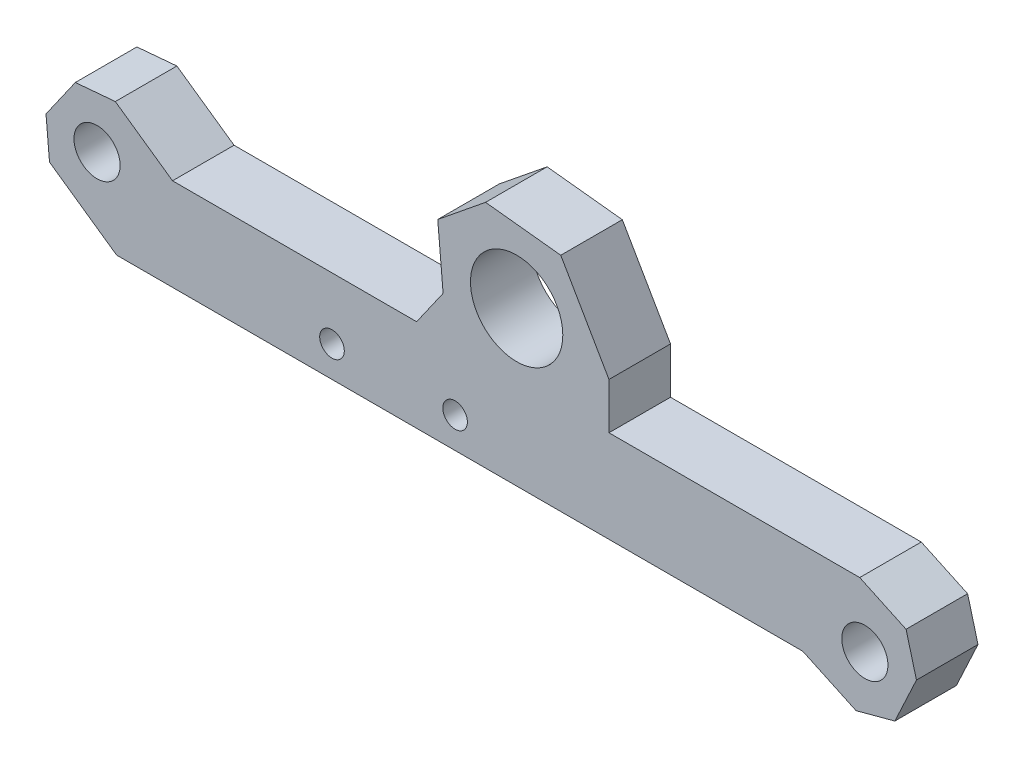
ISO-10303-21;
HEADER;
FILE_DESCRIPTION(('STEP AP214'),'2;1');
FILE_NAME('part.step','',(''),(''),'','','');
FILE_SCHEMA(('AUTOMOTIVE_DESIGN { 1 0 10303 214 1 1 1 1 }'));
ENDSEC;
DATA;
#1=APPLICATION_CONTEXT('core data for automotive mechanical design processes');
#2=APPLICATION_PROTOCOL_DEFINITION('international standard','automotive_design',2000,#1);
#3=PRODUCT_CONTEXT('',#1,'mechanical');
#4=PRODUCT('Part','Part','',(#3));
#5=PRODUCT_RELATED_PRODUCT_CATEGORY('part','',(#4));
#6=PRODUCT_DEFINITION_FORMATION('','',#4);
#7=PRODUCT_DEFINITION_CONTEXT('part definition',#1,'design');
#8=PRODUCT_DEFINITION('design','',#6,#7);
#9=PRODUCT_DEFINITION_SHAPE('','',#8);
#10=(LENGTH_UNIT() NAMED_UNIT(*) SI_UNIT(.MILLI.,.METRE.));
#11=(NAMED_UNIT(*) PLANE_ANGLE_UNIT() SI_UNIT($,.RADIAN.));
#12=(NAMED_UNIT(*) SI_UNIT($,.STERADIAN.) SOLID_ANGLE_UNIT());
#13=UNCERTAINTY_MEASURE_WITH_UNIT(LENGTH_MEASURE(1.E-05),#10,'distance_accuracy_value','');
#14=(GEOMETRIC_REPRESENTATION_CONTEXT(3) GLOBAL_UNCERTAINTY_ASSIGNED_CONTEXT((#13)) GLOBAL_UNIT_ASSIGNED_CONTEXT((#10,
#11,#12)) REPRESENTATION_CONTEXT('',''));
#15=CARTESIAN_POINT('',(0.,0.,0.));
#16=DIRECTION('',(0.,0.,1.));
#17=DIRECTION('',(1.,0.,0.));
#18=AXIS2_PLACEMENT_3D('',#15,#16,#17);
#19=CARTESIAN_POINT('',(0.,0.,4.));
#20=DIRECTION('',(0.,0.,-1.));
#21=DIRECTION('',(-1.,0.,0.));
#22=AXIS2_PLACEMENT_3D('',#19,#20,#21);
#23=PLANE('',#22);
#24=CARTESIAN_POINT('',(14.,2.,4.));
#25=DIRECTION('',(0.,0.,1.));
#26=DIRECTION('',(1.,0.,0.));
#27=AXIS2_PLACEMENT_3D('',#24,#25,#26);
#28=CIRCLE('',#27,0.79999999999999);
#29=CARTESIAN_POINT('',(14.8,2.,4.));
#30=VERTEX_POINT('',#29);
#31=EDGE_CURVE('E208',#30,#30,#28,.T.);
#32=ORIENTED_EDGE('',*,*,#31,.F.);
#33=EDGE_LOOP('',(#32));
#34=FACE_BOUND('',#33,.T.);
#35=CARTESIAN_POINT('',(22.,2.,4.));
#36=DIRECTION('',(0.,0.,1.));
#37=DIRECTION('',(1.,0.,0.));
#38=AXIS2_PLACEMENT_3D('',#35,#36,#37);
#39=CIRCLE('',#38,0.799999999999988);
#40=CARTESIAN_POINT('',(22.8,2.,4.));
#41=VERTEX_POINT('',#40);
#42=EDGE_CURVE('E205',#41,#41,#39,.T.);
#43=ORIENTED_EDGE('',*,*,#42,.F.);
#44=EDGE_LOOP('',(#43));
#45=FACE_BOUND('',#44,.T.);
#46=CARTESIAN_POINT('',(-1.2690906499273,5.16133790041566,4.));
#47=DIRECTION('',(0.,0.,1.));
#48=DIRECTION('',(1.,0.,0.));
#49=AXIS2_PLACEMENT_3D('',#46,#47,#48);
#50=CIRCLE('',#49,1.5);
#51=CARTESIAN_POINT('',(0.230909350072699,5.16133790041566,4.));
#52=VERTEX_POINT('',#51);
#53=EDGE_CURVE('E622',#52,#52,#50,.T.);
#54=ORIENTED_EDGE('',*,*,#53,.F.);
#55=EDGE_LOOP('',(#54));
#56=FACE_BOUND('',#55,.T.);
#57=DIRECTION('',(0.906307787036649,-0.422618261740701,0.));
#58=VECTOR('',#57,1.);
#59=CARTESIAN_POINT('',(44.5999475740209,0.,4.));
#60=LINE('',#59,#58);
#61=CARTESIAN_POINT('',(44.5999475740209,0.,4.));
#62=VERTEX_POINT('',#61);
#63=CARTESIAN_POINT('',(48.0569126619561,-1.61200929447864,4.));
#64=VERTEX_POINT('',#63);
#65=EDGE_CURVE('E187',#62,#64,#60,.T.);
#66=ORIENTED_EDGE('',*,*,#65,.T.);
#67=DIRECTION('',(-0.965925826289069,-0.258819045102517,0.));
#68=VECTOR('',#67,1.);
#69=CARTESIAN_POINT('',(50.5787658911402,-0.936280758288942,4.));
#70=LINE('',#69,#68);
#71=CARTESIAN_POINT('',(50.5787658911402,-0.936280758288942,4.));
#72=VERTEX_POINT('',#71);
#73=EDGE_CURVE('E226',#64,#72,#70,.F.);
#74=ORIENTED_EDGE('',*,*,#73,.T.);
#75=DIRECTION('',(0.422618261740699,0.90630778703665,0.));
#76=VECTOR('',#75,1.);
#77=CARTESIAN_POINT('',(49.8695282360294,-2.45724581796004,4.));
#78=LINE('',#77,#76);
#79=CARTESIAN_POINT('',(51.9826195447329,2.0742931172232,4.));
#80=VERTEX_POINT('',#79);
#81=EDGE_CURVE('E343',#72,#80,#78,.T.);
#82=ORIENTED_EDGE('',*,*,#81,.T.);
#83=DIRECTION('',(0.258819045102522,-0.965925826289068,0.));
#84=VECTOR('',#83,1.);
#85=CARTESIAN_POINT('',(51.3068910085432,4.59614634640732,4.));
#86=LINE('',#85,#84);
#87=CARTESIAN_POINT('',(51.3068910085432,4.59614634640732,4.));
#88=VERTEX_POINT('',#87);
#89=EDGE_CURVE('E224',#80,#88,#86,.F.);
#90=ORIENTED_EDGE('',*,*,#89,.T.);
#91=DIRECTION('',(-0.906307787036649,0.4226182617407,0.));
#92=VECTOR('',#91,1.);
#93=CARTESIAN_POINT('',(48.2963171330311,6.00000000000001,4.));
#94=LINE('',#93,#92);
#95=CARTESIAN_POINT('',(48.2963171330311,6.00000000000001,4.));
#96=VERTEX_POINT('',#95);
#97=EDGE_CURVE('E342',#88,#96,#94,.T.);
#98=ORIENTED_EDGE('',*,*,#97,.T.);
#99=DIRECTION('',(-1.,0.,0.));
#100=VECTOR('',#99,1.);
#101=CARTESIAN_POINT('',(48.2963171330311,6.00000000000001,4.));
#102=LINE('',#101,#100);
#103=CARTESIAN_POINT('',(32.,6.,4.));
#104=VERTEX_POINT('',#103);
#105=EDGE_CURVE('E283',#96,#104,#102,.T.);
#106=ORIENTED_EDGE('',*,*,#105,.T.);
#107=DIRECTION('',(0.,1.,0.));
#108=VECTOR('',#107,1.);
#109=CARTESIAN_POINT('',(32.,9.,4.));
#110=LINE('',#109,#108);
#111=CARTESIAN_POINT('',(32.,9.,4.));
#112=VERTEX_POINT('',#111);
#113=EDGE_CURVE('E346',#104,#112,#110,.T.);
#114=ORIENTED_EDGE('',*,*,#113,.T.);
#115=DIRECTION('',(-0.500000000000001,0.866025403784438,0.));
#116=VECTOR('',#115,1.);
#117=CARTESIAN_POINT('',(28.8672456816101,14.426089647082,4.));
#118=LINE('',#117,#116);
#119=CARTESIAN_POINT('',(28.8672456816101,14.426089647082,4.));
#120=VERTEX_POINT('',#119);
#121=EDGE_CURVE('E352',#112,#120,#118,.T.);
#122=ORIENTED_EDGE('',*,*,#121,.T.);
#123=DIRECTION('',(-0.994094540524916,0.108517484759628,0.));
#124=VECTOR('',#123,1.);
#125=CARTESIAN_POINT('',(28.8672456816101,14.426089647082,4.));
#126=LINE('',#125,#124);
#127=CARTESIAN_POINT('',(23.9806901838903,14.9595164894333,4.));
#128=VERTEX_POINT('',#127);
#129=EDGE_CURVE('E354',#120,#128,#126,.T.);
#130=ORIENTED_EDGE('',*,*,#129,.T.);
#131=DIRECTION('',(-0.777145961456968,-0.62932039104984,0.));
#132=VECTOR('',#131,1.);
#133=CARTESIAN_POINT('',(23.9806901838903,14.9595164894333,4.));
#134=LINE('',#133,#132);
#135=CARTESIAN_POINT('',(20.8721063380625,12.442234925234,4.));
#136=VERTEX_POINT('',#135);
#137=EDGE_CURVE('E356',#128,#136,#134,.T.);
#138=ORIENTED_EDGE('',*,*,#137,.T.);
#139=DIRECTION('',(0.0871557427476631,-0.996194698091745,0.));
#140=VECTOR('',#139,1.);
#141=CARTESIAN_POINT('',(20.8721063380625,12.442234925234,4.));
#142=LINE('',#141,#140);
#143=CARTESIAN_POINT('',(21.2207293090531,8.45745613286698,4.));
#144=VERTEX_POINT('',#143);
#145=EDGE_CURVE('E358',#136,#144,#142,.T.);
#146=ORIENTED_EDGE('',*,*,#145,.T.);
#147=DIRECTION('',(-0.573576436351041,-0.819152044288995,0.));
#148=VECTOR('',#147,1.);
#149=CARTESIAN_POINT('',(21.2207293090531,8.45745613286698,4.));
#150=LINE('',#149,#148);
#151=CARTESIAN_POINT('',(19.5,5.99999999999999,4.));
#152=VERTEX_POINT('',#151);
#153=EDGE_CURVE('E321',#144,#152,#150,.T.);
#154=ORIENTED_EDGE('',*,*,#153,.T.);
#155=DIRECTION('',(-1.,0.,0.));
#156=VECTOR('',#155,1.);
#157=CARTESIAN_POINT('',(19.5,5.99999999999999,4.));
#158=LINE('',#157,#156);
#159=CARTESIAN_POINT('',(3.635239528895,6.,4.));
#160=VERTEX_POINT('',#159);
#161=EDGE_CURVE('E318',#152,#160,#158,.T.);
#162=ORIENTED_EDGE('',*,*,#161,.T.);
#163=DIRECTION('',(-0.819152044288991,0.573576436351047,0.));
#164=VECTOR('',#163,1.);
#165=CARTESIAN_POINT('',(3.635239528895,6.,4.));
#166=LINE('',#165,#164);
#167=CARTESIAN_POINT('',(-0.0807251669876225,8.60194649177817,4.));
#168=VERTEX_POINT('',#167);
#169=EDGE_CURVE('E317',#160,#168,#166,.T.);
#170=ORIENTED_EDGE('',*,*,#169,.T.);
#171=DIRECTION('',(0.996194698091746,0.0871557427476543,0.));
#172=VECTOR('',#171,1.);
#173=CARTESIAN_POINT('',(-2.68160480795389,8.37439900799826,4.));
#174=LINE('',#173,#172);
#175=CARTESIAN_POINT('',(-2.68160480795389,8.37439900799826,4.));
#176=VERTEX_POINT('',#175);
#177=EDGE_CURVE('E58',#168,#176,#174,.F.);
#178=ORIENTED_EDGE('',*,*,#177,.T.);
#179=DIRECTION('',(-0.573576436351047,-0.819152044288992,0.));
#180=VECTOR('',#179,1.);
#181=CARTESIAN_POINT('',(-1.71902925556561,9.74909936448027,4.));
#182=LINE('',#181,#180);
#183=CARTESIAN_POINT('',(-4.58691143732084,5.65333914303532,4.));
#184=VERTEX_POINT('',#183);
#185=EDGE_CURVE('E238',#176,#184,#182,.T.);
#186=ORIENTED_EDGE('',*,*,#185,.T.);
#187=DIRECTION('',(-0.0871557427476553,0.996194698091746,0.));
#188=VECTOR('',#187,1.);
#189=CARTESIAN_POINT('',(-4.35936395354093,3.05245950206905,4.));
#190=LINE('',#189,#188);
#191=CARTESIAN_POINT('',(-4.35936395354093,3.05245950206905,4.));
#192=VERTEX_POINT('',#191);
#193=EDGE_CURVE('E173',#184,#192,#190,.F.);
#194=ORIENTED_EDGE('',*,*,#193,.T.);
#195=DIRECTION('',(0.819152044288991,-0.573576436351047,0.));
#196=VECTOR('',#195,1.);
#197=CARTESIAN_POINT('',(-5.73406431002294,4.01503505445733,4.));
#198=LINE('',#197,#196);
#199=CARTESIAN_POINT('',(0.,0.,4.));
#200=VERTEX_POINT('',#199);
#201=EDGE_CURVE('E166',#192,#200,#198,.T.);
#202=ORIENTED_EDGE('',*,*,#201,.T.);
#203=DIRECTION('',(1.,0.,0.));
#204=VECTOR('',#203,1.);
#205=CARTESIAN_POINT('',(0.,0.,4.));
#206=LINE('',#205,#204);
#207=EDGE_CURVE('E170',#200,#62,#206,.T.);
#208=ORIENTED_EDGE('',*,*,#207,.T.);
#209=EDGE_LOOP('',(#66,#74,#82,#90,#98,#106,#114,#122,#130,#138,#146,#154,#162,#170,#178,#186,
#194,#202,#208));
#210=FACE_BOUND('',#209,.T.);
#211=CARTESIAN_POINT('',(26.,10.,4.));
#212=DIRECTION('',(0.,0.,1.));
#213=DIRECTION('',(1.,0.,0.));
#214=AXIS2_PLACEMENT_3D('',#211,#212,#213);
#215=CIRCLE('',#214,3.);
#216=CARTESIAN_POINT('',(29.,10.,4.));
#217=VERTEX_POINT('',#216);
#218=EDGE_CURVE('E327',#217,#217,#215,.T.);
#219=ORIENTED_EDGE('',*,*,#218,.F.);
#220=EDGE_LOOP('',(#219));
#221=FACE_BOUND('',#220,.T.);
#222=CARTESIAN_POINT('',(48.6297687910119,1.98268622189033,4.));
#223=DIRECTION('',(0.,0.,1.));
#224=DIRECTION('',(-1.,0.,0.));
#225=AXIS2_PLACEMENT_3D('',#222,#223,#224);
#226=CIRCLE('',#225,1.5);
#227=CARTESIAN_POINT('',(47.1297687910119,1.98268622189033,4.));
#228=VERTEX_POINT('',#227);
#229=EDGE_CURVE('E628',#228,#228,#226,.T.);
#230=ORIENTED_EDGE('',*,*,#229,.F.);
#231=EDGE_LOOP('',(#230));
#232=FACE_BOUND('',#231,.T.);
#233=ADVANCED_FACE('F37',(#34,#45,#56,#210,#221,#232),#23,.F.);
#234=CARTESIAN_POINT('',(0.,0.,0.));
#235=DIRECTION('',(0.,0.,-1.));
#236=DIRECTION('',(-1.,0.,0.));
#237=AXIS2_PLACEMENT_3D('',#234,#235,#236);
#238=PLANE('',#237);
#239=CARTESIAN_POINT('',(14.,2.,0.));
#240=DIRECTION('',(0.,0.,-1.));
#241=DIRECTION('',(-1.,0.,0.));
#242=AXIS2_PLACEMENT_3D('',#239,#240,#241);
#243=CIRCLE('',#242,0.799999999999989);
#244=CARTESIAN_POINT('',(13.2,2.,0.));
#245=VERTEX_POINT('',#244);
#246=EDGE_CURVE('E206',#245,#245,#243,.T.);
#247=ORIENTED_EDGE('',*,*,#246,.F.);
#248=EDGE_LOOP('',(#247));
#249=FACE_BOUND('',#248,.T.);
#250=CARTESIAN_POINT('',(22.,2.,0.));
#251=DIRECTION('',(0.,0.,-1.));
#252=DIRECTION('',(-1.,0.,0.));
#253=AXIS2_PLACEMENT_3D('',#250,#251,#252);
#254=CIRCLE('',#253,0.799999999999988);
#255=CARTESIAN_POINT('',(21.2,2.,0.));
#256=VERTEX_POINT('',#255);
#257=EDGE_CURVE('E201',#256,#256,#254,.T.);
#258=ORIENTED_EDGE('',*,*,#257,.F.);
#259=EDGE_LOOP('',(#258));
#260=FACE_BOUND('',#259,.T.);
#261=CARTESIAN_POINT('',(-1.2690906499273,5.16133790041566,0.));
#262=DIRECTION('',(0.,0.,1.));
#263=DIRECTION('',(1.,0.,0.));
#264=AXIS2_PLACEMENT_3D('',#261,#262,#263);
#265=CIRCLE('',#264,1.5);
#266=CARTESIAN_POINT('',(0.230909350072699,5.16133790041566,0.));
#267=VERTEX_POINT('',#266);
#268=EDGE_CURVE('E625',#267,#267,#265,.T.);
#269=ORIENTED_EDGE('',*,*,#268,.T.);
#270=EDGE_LOOP('',(#269));
#271=FACE_BOUND('',#270,.T.);
#272=DIRECTION('',(0.422618261740699,0.90630778703665,0.));
#273=VECTOR('',#272,1.);
#274=CARTESIAN_POINT('',(49.8695282360294,-2.45724581796004,0.));
#275=LINE('',#274,#273);
#276=CARTESIAN_POINT('',(50.5787658911402,-0.936280758288931,0.));
#277=VERTEX_POINT('',#276);
#278=CARTESIAN_POINT('',(51.9826195447329,2.07429311722321,0.));
#279=VERTEX_POINT('',#278);
#280=EDGE_CURVE('E294',#277,#279,#275,.T.);
#281=ORIENTED_EDGE('',*,*,#280,.F.);
#282=DIRECTION('',(0.965925826289069,0.258819045102517,0.));
#283=VECTOR('',#282,1.);
#284=CARTESIAN_POINT('',(3.6222050582456,-13.5182533128058,0.));
#285=LINE('',#284,#283);
#286=CARTESIAN_POINT('',(48.0569126619561,-1.61200929447863,0.));
#287=VERTEX_POINT('',#286);
#288=EDGE_CURVE('E218',#277,#287,#285,.F.);
#289=ORIENTED_EDGE('',*,*,#288,.T.);
#290=DIRECTION('',(0.906307787036649,-0.422618261740701,0.));
#291=VECTOR('',#290,1.);
#292=CARTESIAN_POINT('',(44.5999475740209,0.,0.));
#293=LINE('',#292,#291);
#294=CARTESIAN_POINT('',(44.5999475740209,0.,0.));
#295=VERTEX_POINT('',#294);
#296=EDGE_CURVE('E329',#295,#287,#293,.T.);
#297=ORIENTED_EDGE('',*,*,#296,.F.);
#298=DIRECTION('',(1.,0.,0.));
#299=VECTOR('',#298,1.);
#300=CARTESIAN_POINT('',(0.,0.,0.));
#301=LINE('',#300,#299);
#302=CARTESIAN_POINT('',(0.,0.,0.));
#303=VERTEX_POINT('',#302);
#304=EDGE_CURVE('E326',#303,#295,#301,.T.);
#305=ORIENTED_EDGE('',*,*,#304,.F.);
#306=DIRECTION('',(0.819152044288991,-0.573576436351047,0.));
#307=VECTOR('',#306,1.);
#308=CARTESIAN_POINT('',(-5.73406431002294,4.01503505445733,0.));
#309=LINE('',#308,#307);
#310=CARTESIAN_POINT('',(-4.35936395354093,3.05245950206905,0.));
#311=VERTEX_POINT('',#310);
#312=EDGE_CURVE('E191',#311,#303,#309,.T.);
#313=ORIENTED_EDGE('',*,*,#312,.F.);
#314=DIRECTION('',(0.0871557427476553,-0.996194698091746,0.));
#315=VECTOR('',#314,1.);
#316=CARTESIAN_POINT('',(-4.0612226716268,-0.3553109438218,0.));
#317=LINE('',#316,#315);
#318=CARTESIAN_POINT('',(-4.58691143732084,5.65333914303531,0.));
#319=VERTEX_POINT('',#318);
#320=EDGE_CURVE('E214',#311,#319,#317,.F.);
#321=ORIENTED_EDGE('',*,*,#320,.T.);
#322=DIRECTION('',(-0.573576436351047,-0.819152044288992,0.));
#323=VECTOR('',#322,1.);
#324=CARTESIAN_POINT('',(-1.71902925556561,9.74909936448027,0.));
#325=LINE('',#324,#323);
#326=CARTESIAN_POINT('',(-2.68160480795389,8.37439900799826,0.));
#327=VERTEX_POINT('',#326);
#328=EDGE_CURVE('E178',#327,#319,#325,.T.);
#329=ORIENTED_EDGE('',*,*,#328,.F.);
#330=DIRECTION('',(-0.996194698091746,-0.0871557427476543,0.));
#331=VECTOR('',#330,1.);
#332=CARTESIAN_POINT('',(-0.747469364680332,8.54361393300838,0.));
#333=LINE('',#332,#331);
#334=CARTESIAN_POINT('',(-0.0807251669876249,8.60194649177817,0.));
#335=VERTEX_POINT('',#334);
#336=EDGE_CURVE('E212',#327,#335,#333,.F.);
#337=ORIENTED_EDGE('',*,*,#336,.T.);
#338=DIRECTION('',(-0.819152044288991,0.573576436351047,0.));
#339=VECTOR('',#338,1.);
#340=CARTESIAN_POINT('',(3.635239528895,6.,0.));
#341=LINE('',#340,#339);
#342=CARTESIAN_POINT('',(3.635239528895,6.,0.));
#343=VERTEX_POINT('',#342);
#344=EDGE_CURVE('E246',#343,#335,#341,.T.);
#345=ORIENTED_EDGE('',*,*,#344,.F.);
#346=DIRECTION('',(-1.,0.,0.));
#347=VECTOR('',#346,1.);
#348=CARTESIAN_POINT('',(19.5,5.99999999999999,0.));
#349=LINE('',#348,#347);
#350=CARTESIAN_POINT('',(19.5,5.99999999999999,0.));
#351=VERTEX_POINT('',#350);
#352=EDGE_CURVE('E248',#351,#343,#349,.T.);
#353=ORIENTED_EDGE('',*,*,#352,.F.);
#354=DIRECTION('',(-0.573576436351041,-0.819152044288995,0.));
#355=VECTOR('',#354,1.);
#356=CARTESIAN_POINT('',(21.2207293090531,8.45745613286698,0.));
#357=LINE('',#356,#355);
#358=CARTESIAN_POINT('',(21.2207293090531,8.45745613286698,0.));
#359=VERTEX_POINT('',#358);
#360=EDGE_CURVE('E305',#359,#351,#357,.T.);
#361=ORIENTED_EDGE('',*,*,#360,.F.);
#362=DIRECTION('',(0.0871557427476631,-0.996194698091745,0.));
#363=VECTOR('',#362,1.);
#364=CARTESIAN_POINT('',(20.8721063380625,12.442234925234,0.));
#365=LINE('',#364,#363);
#366=CARTESIAN_POINT('',(20.8721063380625,12.442234925234,0.));
#367=VERTEX_POINT('',#366);
#368=EDGE_CURVE('E303',#367,#359,#365,.T.);
#369=ORIENTED_EDGE('',*,*,#368,.F.);
#370=DIRECTION('',(-0.777145961456968,-0.62932039104984,0.));
#371=VECTOR('',#370,1.);
#372=CARTESIAN_POINT('',(23.9806901838903,14.9595164894333,0.));
#373=LINE('',#372,#371);
#374=CARTESIAN_POINT('',(23.9806901838903,14.9595164894333,0.));
#375=VERTEX_POINT('',#374);
#376=EDGE_CURVE('E301',#375,#367,#373,.T.);
#377=ORIENTED_EDGE('',*,*,#376,.F.);
#378=DIRECTION('',(-0.994094540524916,0.108517484759628,0.));
#379=VECTOR('',#378,1.);
#380=CARTESIAN_POINT('',(28.8672456816101,14.426089647082,0.));
#381=LINE('',#380,#379);
#382=CARTESIAN_POINT('',(28.8672456816101,14.426089647082,0.));
#383=VERTEX_POINT('',#382);
#384=EDGE_CURVE('E299',#383,#375,#381,.T.);
#385=ORIENTED_EDGE('',*,*,#384,.F.);
#386=DIRECTION('',(-0.500000000000001,0.866025403784438,0.));
#387=VECTOR('',#386,1.);
#388=CARTESIAN_POINT('',(28.8672456816101,14.426089647082,0.));
#389=LINE('',#388,#387);
#390=CARTESIAN_POINT('',(32.,9.,0.));
#391=VERTEX_POINT('',#390);
#392=EDGE_CURVE('E292',#391,#383,#389,.T.);
#393=ORIENTED_EDGE('',*,*,#392,.F.);
#394=DIRECTION('',(0.,1.,0.));
#395=VECTOR('',#394,1.);
#396=CARTESIAN_POINT('',(32.,9.,0.));
#397=LINE('',#396,#395);
#398=CARTESIAN_POINT('',(32.,6.,0.));
#399=VERTEX_POINT('',#398);
#400=EDGE_CURVE('E290',#399,#391,#397,.T.);
#401=ORIENTED_EDGE('',*,*,#400,.F.);
#402=DIRECTION('',(-1.,0.,0.));
#403=VECTOR('',#402,1.);
#404=CARTESIAN_POINT('',(48.2963171330311,6.00000000000001,0.));
#405=LINE('',#404,#403);
#406=CARTESIAN_POINT('',(48.2963171330311,6.00000000000001,0.));
#407=VERTEX_POINT('',#406);
#408=EDGE_CURVE('E282',#407,#399,#405,.T.);
#409=ORIENTED_EDGE('',*,*,#408,.F.);
#410=DIRECTION('',(-0.906307787036649,0.4226182617407,0.));
#411=VECTOR('',#410,1.);
#412=CARTESIAN_POINT('',(48.2963171330311,6.00000000000001,0.));
#413=LINE('',#412,#411);
#414=CARTESIAN_POINT('',(51.3068910085432,4.59614634640731,0.));
#415=VERTEX_POINT('',#414);
#416=EDGE_CURVE('E288',#415,#407,#413,.T.);
#417=ORIENTED_EDGE('',*,*,#416,.F.);
#418=DIRECTION('',(-0.258819045102522,0.965925826289068,0.));
#419=VECTOR('',#418,1.);
#420=CARTESIAN_POINT('',(49.0190175921723,13.1346061775896,0.));
#421=LINE('',#420,#419);
#422=EDGE_CURVE('E216',#415,#279,#421,.F.);
#423=ORIENTED_EDGE('',*,*,#422,.T.);
#424=EDGE_LOOP('',(#281,#289,#297,#305,#313,#321,#329,#337,#345,#353,#361,#369,#377,#385,#393,
#401,#409,#417,#423));
#425=FACE_BOUND('',#424,.T.);
#426=CARTESIAN_POINT('',(26.,10.,0.));
#427=DIRECTION('',(0.,0.,1.));
#428=DIRECTION('',(1.,0.,0.));
#429=AXIS2_PLACEMENT_3D('',#426,#427,#428);
#430=CIRCLE('',#429,3.);
#431=CARTESIAN_POINT('',(29.,10.,0.));
#432=VERTEX_POINT('',#431);
#433=EDGE_CURVE('E619',#432,#432,#430,.T.);
#434=ORIENTED_EDGE('',*,*,#433,.T.);
#435=EDGE_LOOP('',(#434));
#436=FACE_BOUND('',#435,.T.);
#437=CARTESIAN_POINT('',(48.6297687910119,1.98268622189033,0.));
#438=DIRECTION('',(0.,0.,1.));
#439=DIRECTION('',(-1.,0.,0.));
#440=AXIS2_PLACEMENT_3D('',#437,#438,#439);
#441=CIRCLE('',#440,1.5);
#442=CARTESIAN_POINT('',(47.1297687910119,1.98268622189033,0.));
#443=VERTEX_POINT('',#442);
#444=EDGE_CURVE('E204',#443,#443,#441,.T.);
#445=ORIENTED_EDGE('',*,*,#444,.T.);
#446=EDGE_LOOP('',(#445));
#447=FACE_BOUND('',#446,.T.);
#448=ADVANCED_FACE('F242',(#249,#260,#271,#425,#436,#447),#238,.T.);
#449=CARTESIAN_POINT('',(-5.73406431002294,4.01503505445733,4.));
#450=DIRECTION('',(0.573576436351047,0.819152044288991,0.));
#451=DIRECTION('',(-0.819152044288991,0.573576436351047,0.));
#452=AXIS2_PLACEMENT_3D('',#449,#450,#451);
#453=PLANE('',#452);
#454=ORIENTED_EDGE('',*,*,#201,.F.);
#455=DIRECTION('',(0.,0.,-1.));
#456=VECTOR('',#455,1.);
#457=CARTESIAN_POINT('',(-4.35936395354093,3.05245950206905,4.));
#458=LINE('',#457,#456);
#459=EDGE_CURVE('E231',#192,#311,#458,.T.);
#460=ORIENTED_EDGE('',*,*,#459,.T.);
#461=ORIENTED_EDGE('',*,*,#312,.T.);
#462=DIRECTION('',(0.,0.,-1.));
#463=VECTOR('',#462,1.);
#464=CARTESIAN_POINT('',(0.,0.,4.));
#465=LINE('',#464,#463);
#466=EDGE_CURVE('E183',#200,#303,#465,.T.);
#467=ORIENTED_EDGE('',*,*,#466,.F.);
#468=EDGE_LOOP('',(#454,#460,#461,#467));
#469=FACE_BOUND('',#468,.T.);
#470=ADVANCED_FACE('F189',(#469),#453,.F.);
#471=CARTESIAN_POINT('',(0.,0.,4.));
#472=DIRECTION('',(0.,1.,0.));
#473=DIRECTION('',(0.,0.,1.));
#474=AXIS2_PLACEMENT_3D('',#471,#472,#473);
#475=PLANE('',#474);
#476=ORIENTED_EDGE('',*,*,#304,.T.);
#477=DIRECTION('',(0.,0.,-1.));
#478=VECTOR('',#477,1.);
#479=CARTESIAN_POINT('',(44.5999475740209,0.,4.));
#480=LINE('',#479,#478);
#481=EDGE_CURVE('E185',#62,#295,#480,.T.);
#482=ORIENTED_EDGE('',*,*,#481,.F.);
#483=ORIENTED_EDGE('',*,*,#207,.F.);
#484=ORIENTED_EDGE('',*,*,#466,.T.);
#485=EDGE_LOOP('',(#476,#482,#483,#484));
#486=FACE_BOUND('',#485,.T.);
#487=ADVANCED_FACE('F182',(#486),#475,.F.);
#488=CARTESIAN_POINT('',(44.5999475740209,0.,4.));
#489=DIRECTION('',(0.422618261740701,0.906307787036649,0.));
#490=DIRECTION('',(-0.906307787036649,0.422618261740701,0.));
#491=AXIS2_PLACEMENT_3D('',#488,#489,#490);
#492=PLANE('',#491);
#493=ORIENTED_EDGE('',*,*,#296,.T.);
#494=DIRECTION('',(0.,0.,1.));
#495=VECTOR('',#494,1.);
#496=CARTESIAN_POINT('',(48.0569126619561,-1.61200929447864,4.));
#497=LINE('',#496,#495);
#498=EDGE_CURVE('E220',#287,#64,#497,.T.);
#499=ORIENTED_EDGE('',*,*,#498,.T.);
#500=ORIENTED_EDGE('',*,*,#65,.F.);
#501=ORIENTED_EDGE('',*,*,#481,.T.);
#502=EDGE_LOOP('',(#493,#499,#500,#501));
#503=FACE_BOUND('',#502,.T.);
#504=ADVANCED_FACE('F576',(#503),#492,.F.);
#505=CARTESIAN_POINT('',(49.8695282360294,-2.45724581796004,4.));
#506=DIRECTION('',(-0.90630778703665,0.422618261740699,0.));
#507=DIRECTION('',(-0.422618261740699,-0.90630778703665,0.));
#508=AXIS2_PLACEMENT_3D('',#505,#506,#507);
#509=PLANE('',#508);
#510=ORIENTED_EDGE('',*,*,#81,.F.);
#511=DIRECTION('',(0.,0.,-1.));
#512=VECTOR('',#511,1.);
#513=CARTESIAN_POINT('',(50.5787658911402,-0.936280758288942,4.));
#514=LINE('',#513,#512);
#515=EDGE_CURVE('E195',#72,#277,#514,.T.);
#516=ORIENTED_EDGE('',*,*,#515,.T.);
#517=ORIENTED_EDGE('',*,*,#280,.T.);
#518=DIRECTION('',(0.,0.,1.));
#519=VECTOR('',#518,1.);
#520=CARTESIAN_POINT('',(51.9826195447329,2.07429311722321,4.));
#521=LINE('',#520,#519);
#522=EDGE_CURVE('E193',#279,#80,#521,.T.);
#523=ORIENTED_EDGE('',*,*,#522,.T.);
#524=EDGE_LOOP('',(#510,#516,#517,#523));
#525=FACE_BOUND('',#524,.T.);
#526=ADVANCED_FACE('F335',(#525),#509,.F.);
#527=CARTESIAN_POINT('',(48.2963171330311,6.00000000000001,4.));
#528=DIRECTION('',(-0.4226182617407,-0.906307787036649,0.));
#529=DIRECTION('',(0.906307787036649,-0.4226182617407,0.));
#530=AXIS2_PLACEMENT_3D('',#527,#528,#529);
#531=PLANE('',#530);
#532=ORIENTED_EDGE('',*,*,#97,.F.);
#533=DIRECTION('',(0.,0.,-1.));
#534=VECTOR('',#533,1.);
#535=CARTESIAN_POINT('',(51.3068910085432,4.59614634640732,4.));
#536=LINE('',#535,#534);
#537=EDGE_CURVE('E228',#88,#415,#536,.T.);
#538=ORIENTED_EDGE('',*,*,#537,.T.);
#539=ORIENTED_EDGE('',*,*,#416,.T.);
#540=DIRECTION('',(0.,0.,-1.));
#541=VECTOR('',#540,1.);
#542=CARTESIAN_POINT('',(48.2963171330311,6.00000000000001,4.));
#543=LINE('',#542,#541);
#544=EDGE_CURVE('E197',#96,#407,#543,.T.);
#545=ORIENTED_EDGE('',*,*,#544,.F.);
#546=EDGE_LOOP('',(#532,#538,#539,#545));
#547=FACE_BOUND('',#546,.T.);
#548=ADVANCED_FACE('F344',(#547),#531,.F.);
#549=CARTESIAN_POINT('',(48.2963171330311,6.00000000000001,4.));
#550=DIRECTION('',(0.,-1.,0.));
#551=DIRECTION('',(1.,0.,0.));
#552=AXIS2_PLACEMENT_3D('',#549,#550,#551);
#553=PLANE('',#552);
#554=ORIENTED_EDGE('',*,*,#408,.T.);
#555=DIRECTION('',(0.,0.,-1.));
#556=VECTOR('',#555,1.);
#557=CARTESIAN_POINT('',(32.,6.,4.));
#558=LINE('',#557,#556);
#559=EDGE_CURVE('E273',#104,#399,#558,.T.);
#560=ORIENTED_EDGE('',*,*,#559,.F.);
#561=ORIENTED_EDGE('',*,*,#105,.F.);
#562=ORIENTED_EDGE('',*,*,#544,.T.);
#563=EDGE_LOOP('',(#554,#560,#561,#562));
#564=FACE_BOUND('',#563,.T.);
#565=ADVANCED_FACE('F280',(#564),#553,.F.);
#566=CARTESIAN_POINT('',(32.,9.,4.));
#567=DIRECTION('',(-1.,0.,0.));
#568=DIRECTION('',(0.,-1.,0.));
#569=AXIS2_PLACEMENT_3D('',#566,#567,#568);
#570=PLANE('',#569);
#571=ORIENTED_EDGE('',*,*,#400,.T.);
#572=DIRECTION('',(0.,0.,-1.));
#573=VECTOR('',#572,1.);
#574=CARTESIAN_POINT('',(32.,9.,4.));
#575=LINE('',#574,#573);
#576=EDGE_CURVE('E270',#112,#391,#575,.T.);
#577=ORIENTED_EDGE('',*,*,#576,.F.);
#578=ORIENTED_EDGE('',*,*,#113,.F.);
#579=ORIENTED_EDGE('',*,*,#559,.T.);
#580=EDGE_LOOP('',(#571,#577,#578,#579));
#581=FACE_BOUND('',#580,.T.);
#582=ADVANCED_FACE('F384',(#581),#570,.F.);
#583=CARTESIAN_POINT('',(28.8672456816101,14.426089647082,4.));
#584=DIRECTION('',(-0.866025403784438,-0.500000000000001,0.));
#585=DIRECTION('',(0.500000000000001,-0.866025403784438,0.));
#586=AXIS2_PLACEMENT_3D('',#583,#584,#585);
#587=PLANE('',#586);
#588=ORIENTED_EDGE('',*,*,#392,.T.);
#589=DIRECTION('',(0.,0.,-1.));
#590=VECTOR('',#589,1.);
#591=CARTESIAN_POINT('',(28.8672456816101,14.426089647082,4.));
#592=LINE('',#591,#590);
#593=EDGE_CURVE('E267',#120,#383,#592,.T.);
#594=ORIENTED_EDGE('',*,*,#593,.F.);
#595=ORIENTED_EDGE('',*,*,#121,.F.);
#596=ORIENTED_EDGE('',*,*,#576,.T.);
#597=EDGE_LOOP('',(#588,#594,#595,#596));
#598=FACE_BOUND('',#597,.T.);
#599=ADVANCED_FACE('F379',(#598),#587,.F.);
#600=CARTESIAN_POINT('',(28.8672456816101,14.426089647082,4.));
#601=DIRECTION('',(-0.108517484759628,-0.994094540524916,0.));
#602=DIRECTION('',(0.994094540524916,-0.108517484759628,0.));
#603=AXIS2_PLACEMENT_3D('',#600,#601,#602);
#604=PLANE('',#603);
#605=ORIENTED_EDGE('',*,*,#384,.T.);
#606=DIRECTION('',(0.,0.,-1.));
#607=VECTOR('',#606,1.);
#608=CARTESIAN_POINT('',(23.9806901838903,14.9595164894333,4.));
#609=LINE('',#608,#607);
#610=EDGE_CURVE('E264',#128,#375,#609,.T.);
#611=ORIENTED_EDGE('',*,*,#610,.F.);
#612=ORIENTED_EDGE('',*,*,#129,.F.);
#613=ORIENTED_EDGE('',*,*,#593,.T.);
#614=EDGE_LOOP('',(#605,#611,#612,#613));
#615=FACE_BOUND('',#614,.T.);
#616=ADVANCED_FACE('F376',(#615),#604,.F.);
#617=CARTESIAN_POINT('',(23.9806901838903,14.9595164894333,4.));
#618=DIRECTION('',(0.62932039104984,-0.777145961456968,0.));
#619=DIRECTION('',(0.777145961456968,0.62932039104984,0.));
#620=AXIS2_PLACEMENT_3D('',#617,#618,#619);
#621=PLANE('',#620);
#622=ORIENTED_EDGE('',*,*,#376,.T.);
#623=DIRECTION('',(0.,0.,-1.));
#624=VECTOR('',#623,1.);
#625=CARTESIAN_POINT('',(20.8721063380625,12.442234925234,4.));
#626=LINE('',#625,#624);
#627=EDGE_CURVE('E261',#136,#367,#626,.T.);
#628=ORIENTED_EDGE('',*,*,#627,.F.);
#629=ORIENTED_EDGE('',*,*,#137,.F.);
#630=ORIENTED_EDGE('',*,*,#610,.T.);
#631=EDGE_LOOP('',(#622,#628,#629,#630));
#632=FACE_BOUND('',#631,.T.);
#633=ADVANCED_FACE('F372',(#632),#621,.F.);
#634=CARTESIAN_POINT('',(20.8721063380625,12.442234925234,4.));
#635=DIRECTION('',(0.996194698091745,0.0871557427476631,0.));
#636=DIRECTION('',(-0.0871557427476631,0.996194698091745,0.));
#637=AXIS2_PLACEMENT_3D('',#634,#635,#636);
#638=PLANE('',#637);
#639=ORIENTED_EDGE('',*,*,#368,.T.);
#640=DIRECTION('',(0.,0.,-1.));
#641=VECTOR('',#640,1.);
#642=CARTESIAN_POINT('',(21.2207293090531,8.45745613286698,4.));
#643=LINE('',#642,#641);
#644=EDGE_CURVE('E258',#144,#359,#643,.T.);
#645=ORIENTED_EDGE('',*,*,#644,.F.);
#646=ORIENTED_EDGE('',*,*,#145,.F.);
#647=ORIENTED_EDGE('',*,*,#627,.T.);
#648=EDGE_LOOP('',(#639,#645,#646,#647));
#649=FACE_BOUND('',#648,.T.);
#650=ADVANCED_FACE('F368',(#649),#638,.F.);
#651=CARTESIAN_POINT('',(21.2207293090531,8.45745613286698,4.));
#652=DIRECTION('',(0.819152044288995,-0.573576436351041,0.));
#653=DIRECTION('',(0.573576436351041,0.819152044288995,0.));
#654=AXIS2_PLACEMENT_3D('',#651,#652,#653);
#655=PLANE('',#654);
#656=ORIENTED_EDGE('',*,*,#360,.T.);
#657=DIRECTION('',(0.,0.,-1.));
#658=VECTOR('',#657,1.);
#659=CARTESIAN_POINT('',(19.5,5.99999999999999,4.));
#660=LINE('',#659,#658);
#661=EDGE_CURVE('E255',#152,#351,#660,.T.);
#662=ORIENTED_EDGE('',*,*,#661,.F.);
#663=ORIENTED_EDGE('',*,*,#153,.F.);
#664=ORIENTED_EDGE('',*,*,#644,.T.);
#665=EDGE_LOOP('',(#656,#662,#663,#664));
#666=FACE_BOUND('',#665,.T.);
#667=ADVANCED_FACE('F363',(#666),#655,.F.);
#668=CARTESIAN_POINT('',(19.5,5.99999999999999,4.));
#669=DIRECTION('',(0.,-1.,0.));
#670=DIRECTION('',(1.,0.,0.));
#671=AXIS2_PLACEMENT_3D('',#668,#669,#670);
#672=PLANE('',#671);
#673=ORIENTED_EDGE('',*,*,#352,.T.);
#674=DIRECTION('',(0.,0.,-1.));
#675=VECTOR('',#674,1.);
#676=CARTESIAN_POINT('',(3.635239528895,6.,4.));
#677=LINE('',#676,#675);
#678=EDGE_CURVE('E252',#160,#343,#677,.T.);
#679=ORIENTED_EDGE('',*,*,#678,.F.);
#680=ORIENTED_EDGE('',*,*,#161,.F.);
#681=ORIENTED_EDGE('',*,*,#661,.T.);
#682=EDGE_LOOP('',(#673,#679,#680,#681));
#683=FACE_BOUND('',#682,.T.);
#684=ADVANCED_FACE('F309',(#683),#672,.F.);
#685=CARTESIAN_POINT('',(3.635239528895,6.,4.));
#686=DIRECTION('',(-0.573576436351047,-0.819152044288991,0.));
#687=DIRECTION('',(0.819152044288991,-0.573576436351047,0.));
#688=AXIS2_PLACEMENT_3D('',#685,#686,#687);
#689=PLANE('',#688);
#690=ORIENTED_EDGE('',*,*,#344,.T.);
#691=DIRECTION('',(0.,0.,1.));
#692=VECTOR('',#691,1.);
#693=CARTESIAN_POINT('',(-0.0807251669876249,8.60194649177817,4.));
#694=LINE('',#693,#692);
#695=EDGE_CURVE('E11',#335,#168,#694,.T.);
#696=ORIENTED_EDGE('',*,*,#695,.T.);
#697=ORIENTED_EDGE('',*,*,#169,.F.);
#698=ORIENTED_EDGE('',*,*,#678,.T.);
#699=EDGE_LOOP('',(#690,#696,#697,#698));
#700=FACE_BOUND('',#699,.T.);
#701=ADVANCED_FACE('F315',(#700),#689,.F.);
#702=CARTESIAN_POINT('',(-1.71902925556561,9.74909936448027,4.));
#703=DIRECTION('',(0.819152044288992,-0.573576436351047,0.));
#704=DIRECTION('',(0.573576436351047,0.819152044288992,0.));
#705=AXIS2_PLACEMENT_3D('',#702,#703,#704);
#706=PLANE('',#705);
#707=ORIENTED_EDGE('',*,*,#328,.T.);
#708=DIRECTION('',(0.,0.,1.));
#709=VECTOR('',#708,1.);
#710=CARTESIAN_POINT('',(-4.58691143732084,5.65333914303531,4.));
#711=LINE('',#710,#709);
#712=EDGE_CURVE('E45',#319,#184,#711,.T.);
#713=ORIENTED_EDGE('',*,*,#712,.T.);
#714=ORIENTED_EDGE('',*,*,#185,.F.);
#715=DIRECTION('',(0.,0.,-1.));
#716=VECTOR('',#715,1.);
#717=CARTESIAN_POINT('',(-2.68160480795389,8.37439900799826,4.));
#718=LINE('',#717,#716);
#719=EDGE_CURVE('E233',#176,#327,#718,.T.);
#720=ORIENTED_EDGE('',*,*,#719,.T.);
#721=EDGE_LOOP('',(#707,#713,#714,#720));
#722=FACE_BOUND('',#721,.T.);
#723=ADVANCED_FACE('F237',(#722),#706,.F.);
#724=CARTESIAN_POINT('',(26.,10.,4.));
#725=DIRECTION('',(0.,0.,-1.));
#726=DIRECTION('',(-1.,0.,0.));
#727=AXIS2_PLACEMENT_3D('',#724,#725,#726);
#728=CYLINDRICAL_SURFACE('',#727,3.);
#729=ORIENTED_EDGE('',*,*,#218,.T.);
#730=EDGE_LOOP('',(#729));
#731=FACE_BOUND('',#730,.T.);
#732=ORIENTED_EDGE('',*,*,#433,.F.);
#733=EDGE_LOOP('',(#732));
#734=FACE_BOUND('',#733,.T.);
#735=ADVANCED_FACE('F404',(#731,#734),#728,.F.);
#736=CARTESIAN_POINT('',(-1.2690906499273,5.16133790041566,4.));
#737=DIRECTION('',(0.,0.,-1.));
#738=DIRECTION('',(-1.,0.,0.));
#739=AXIS2_PLACEMENT_3D('',#736,#737,#738);
#740=CYLINDRICAL_SURFACE('',#739,1.5);
#741=ORIENTED_EDGE('',*,*,#53,.T.);
#742=EDGE_LOOP('',(#741));
#743=FACE_BOUND('',#742,.T.);
#744=ORIENTED_EDGE('',*,*,#268,.F.);
#745=EDGE_LOOP('',(#744));
#746=FACE_BOUND('',#745,.T.);
#747=ADVANCED_FACE('F456',(#743,#746),#740,.F.);
#748=CARTESIAN_POINT('',(48.6297687910119,1.98268622189033,4.));
#749=DIRECTION('',(0.,0.,-1.));
#750=DIRECTION('',(-1.,0.,0.));
#751=AXIS2_PLACEMENT_3D('',#748,#749,#750);
#752=CYLINDRICAL_SURFACE('',#751,1.5);
#753=ORIENTED_EDGE('',*,*,#229,.T.);
#754=EDGE_LOOP('',(#753));
#755=FACE_BOUND('',#754,.T.);
#756=ORIENTED_EDGE('',*,*,#444,.F.);
#757=EDGE_LOOP('',(#756));
#758=FACE_BOUND('',#757,.T.);
#759=ADVANCED_FACE('F463',(#755,#758),#752,.F.);
#760=CARTESIAN_POINT('',(22.,2.,4.));
#761=DIRECTION('',(0.,0.,1.));
#762=DIRECTION('',(1.,0.,0.));
#763=AXIS2_PLACEMENT_3D('',#760,#761,#762);
#764=CYLINDRICAL_SURFACE('',#763,0.799999999999988);
#765=ORIENTED_EDGE('',*,*,#257,.T.);
#766=EDGE_LOOP('',(#765));
#767=FACE_BOUND('',#766,.T.);
#768=ORIENTED_EDGE('',*,*,#42,.T.);
#769=EDGE_LOOP('',(#768));
#770=FACE_BOUND('',#769,.T.);
#771=ADVANCED_FACE('F470',(#767,#770),#764,.F.);
#772=CARTESIAN_POINT('',(14.,2.,4.));
#773=DIRECTION('',(0.,0.,1.));
#774=DIRECTION('',(1.,0.,0.));
#775=AXIS2_PLACEMENT_3D('',#772,#773,#774);
#776=CYLINDRICAL_SURFACE('',#775,0.799999999999989);
#777=ORIENTED_EDGE('',*,*,#246,.T.);
#778=EDGE_LOOP('',(#777));
#779=FACE_BOUND('',#778,.T.);
#780=ORIENTED_EDGE('',*,*,#31,.T.);
#781=EDGE_LOOP('',(#780));
#782=FACE_BOUND('',#781,.T.);
#783=ADVANCED_FACE('F479',(#779,#782),#776,.F.);
#784=CARTESIAN_POINT('',(50.5787658911402,-0.936280758288942,4.));
#785=DIRECTION('',(-0.258819045102517,0.965925826289069,0.));
#786=DIRECTION('',(0.,0.,-1.));
#787=AXIS2_PLACEMENT_3D('',#784,#785,#786);
#788=PLANE('',#787);
#789=ORIENTED_EDGE('',*,*,#73,.F.);
#790=ORIENTED_EDGE('',*,*,#498,.F.);
#791=ORIENTED_EDGE('',*,*,#288,.F.);
#792=ORIENTED_EDGE('',*,*,#515,.F.);
#793=EDGE_LOOP('',(#789,#790,#791,#792));
#794=FACE_BOUND('',#793,.T.);
#795=ADVANCED_FACE('F486',(#794),#788,.F.);
#796=CARTESIAN_POINT('',(51.3068910085432,4.59614634640732,4.));
#797=DIRECTION('',(-0.965925826289068,-0.258819045102522,0.));
#798=DIRECTION('',(0.,0.,-1.));
#799=AXIS2_PLACEMENT_3D('',#796,#797,#798);
#800=PLANE('',#799);
#801=ORIENTED_EDGE('',*,*,#89,.F.);
#802=ORIENTED_EDGE('',*,*,#522,.F.);
#803=ORIENTED_EDGE('',*,*,#422,.F.);
#804=ORIENTED_EDGE('',*,*,#537,.F.);
#805=EDGE_LOOP('',(#801,#802,#803,#804));
#806=FACE_BOUND('',#805,.T.);
#807=ADVANCED_FACE('F340',(#806),#800,.F.);
#808=CARTESIAN_POINT('',(-4.35936395354093,3.05245950206905,4.));
#809=DIRECTION('',(0.996194698091746,0.0871557427476553,0.));
#810=DIRECTION('',(0.,0.,-1.));
#811=AXIS2_PLACEMENT_3D('',#808,#809,#810);
#812=PLANE('',#811);
#813=ORIENTED_EDGE('',*,*,#193,.F.);
#814=ORIENTED_EDGE('',*,*,#712,.F.);
#815=ORIENTED_EDGE('',*,*,#320,.F.);
#816=ORIENTED_EDGE('',*,*,#459,.F.);
#817=EDGE_LOOP('',(#813,#814,#815,#816));
#818=FACE_BOUND('',#817,.T.);
#819=ADVANCED_FACE('F500',(#818),#812,.F.);
#820=CARTESIAN_POINT('',(-2.68160480795389,8.37439900799826,4.));
#821=DIRECTION('',(0.0871557427476543,-0.996194698091746,0.));
#822=DIRECTION('',(0.,0.,-1.));
#823=AXIS2_PLACEMENT_3D('',#820,#821,#822);
#824=PLANE('',#823);
#825=ORIENTED_EDGE('',*,*,#177,.F.);
#826=ORIENTED_EDGE('',*,*,#695,.F.);
#827=ORIENTED_EDGE('',*,*,#336,.F.);
#828=ORIENTED_EDGE('',*,*,#719,.F.);
#829=EDGE_LOOP('',(#825,#826,#827,#828));
#830=FACE_BOUND('',#829,.T.);
#831=ADVANCED_FACE('F39',(#830),#824,.F.);
#832=CLOSED_SHELL('',(#233,#448,#470,#487,#504,#526,#548,#565,#582,#599,#616,#633,#650,#667,
#684,#701,#723,#735,#747,#759,#771,#783,#795,#807,#819,#831));
#833=MANIFOLD_SOLID_BREP('B2',#832);
#834=ADVANCED_BREP_SHAPE_REPRESENTATION('',(#18,#833),#14);
#835=SHAPE_DEFINITION_REPRESENTATION(#9,#834);
ENDSEC;
END-ISO-10303-21;
